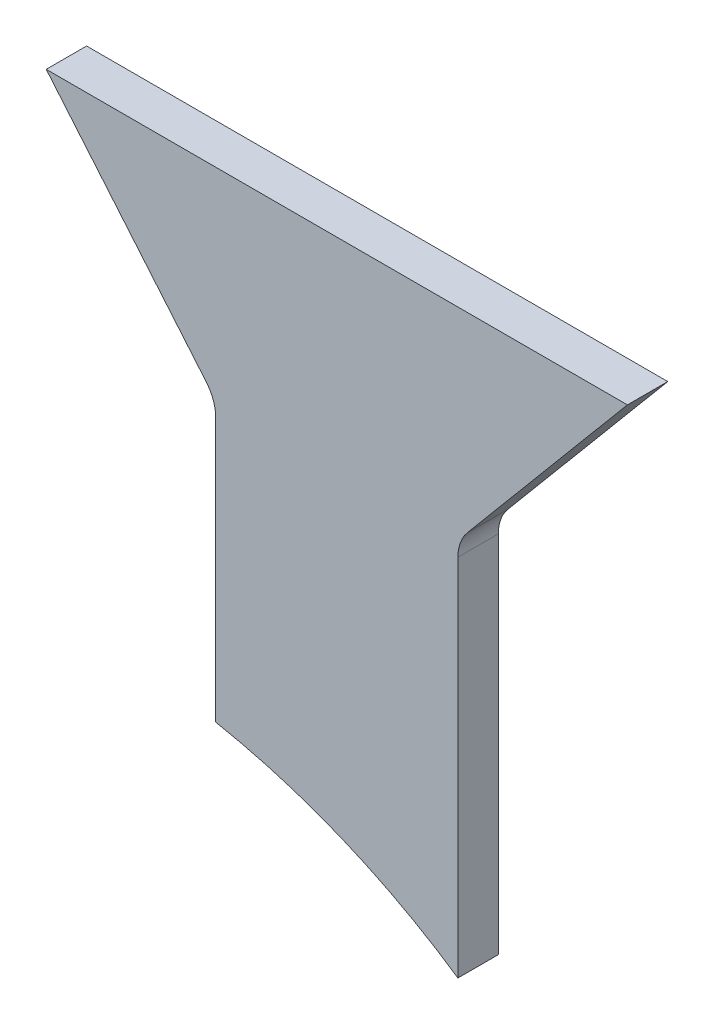
ISO-10303-21;
HEADER;
FILE_DESCRIPTION(('STEP AP214'),'2;1');
FILE_NAME('part.step','',(''),(''),'','','');
FILE_SCHEMA(('AUTOMOTIVE_DESIGN { 1 0 10303 214 1 1 1 1 }'));
ENDSEC;
DATA;
#1=APPLICATION_CONTEXT('core data for automotive mechanical design processes');
#2=APPLICATION_PROTOCOL_DEFINITION('international standard','automotive_design',2000,#1);
#3=PRODUCT_CONTEXT('',#1,'mechanical');
#4=PRODUCT('Part','Part','',(#3));
#5=PRODUCT_RELATED_PRODUCT_CATEGORY('part','',(#4));
#6=PRODUCT_DEFINITION_FORMATION('','',#4);
#7=PRODUCT_DEFINITION_CONTEXT('part definition',#1,'design');
#8=PRODUCT_DEFINITION('design','',#6,#7);
#9=PRODUCT_DEFINITION_SHAPE('','',#8);
#10=(LENGTH_UNIT() NAMED_UNIT(*) SI_UNIT(.MILLI.,.METRE.));
#11=(NAMED_UNIT(*) PLANE_ANGLE_UNIT() SI_UNIT($,.RADIAN.));
#12=(NAMED_UNIT(*) SI_UNIT($,.STERADIAN.) SOLID_ANGLE_UNIT());
#13=UNCERTAINTY_MEASURE_WITH_UNIT(LENGTH_MEASURE(1.E-05),#10,'distance_accuracy_value','');
#14=(GEOMETRIC_REPRESENTATION_CONTEXT(3) GLOBAL_UNCERTAINTY_ASSIGNED_CONTEXT((#13)) GLOBAL_UNIT_ASSIGNED_CONTEXT((#10,
#11,#12)) REPRESENTATION_CONTEXT('',''));
#15=CARTESIAN_POINT('',(0.,0.,0.));
#16=DIRECTION('',(0.,0.,1.));
#17=DIRECTION('',(1.,0.,0.));
#18=AXIS2_PLACEMENT_3D('',#15,#16,#17);
#19=CARTESIAN_POINT('',(-60.,-132.28756555323,10.));
#20=DIRECTION('',(0.,0.,-1.));
#21=DIRECTION('',(-1.,0.,0.));
#22=AXIS2_PLACEMENT_3D('',#19,#20,#21);
#23=CYLINDRICAL_SURFACE('',#22,160.);
#24=CARTESIAN_POINT('',(-60.,-132.28756555323,0.));
#25=DIRECTION('',(0.,0.,-1.));
#26=DIRECTION('',(1.,0.,0.));
#27=AXIS2_PLACEMENT_3D('',#24,#25,#26);
#28=CIRCLE('',#27,160.);
#29=CARTESIAN_POINT('',(-30.,24.8747709017876,0.));
#30=VERTEX_POINT('',#29);
#31=CARTESIAN_POINT('',(30.,0.,0.));
#32=VERTEX_POINT('',#31);
#33=EDGE_CURVE('E118',#30,#32,#28,.T.);
#34=ORIENTED_EDGE('',*,*,#33,.T.);
#35=DIRECTION('',(0.,0.,-1.));
#36=VECTOR('',#35,1.);
#37=CARTESIAN_POINT('',(30.,0.,10.));
#38=LINE('',#37,#36);
#39=CARTESIAN_POINT('',(30.,0.,10.));
#40=VERTEX_POINT('',#39);
#41=EDGE_CURVE('E101',#40,#32,#38,.T.);
#42=ORIENTED_EDGE('',*,*,#41,.F.);
#43=CARTESIAN_POINT('',(-60.,-132.28756555323,10.));
#44=DIRECTION('',(0.,0.,-1.));
#45=DIRECTION('',(1.,0.,0.));
#46=AXIS2_PLACEMENT_3D('',#43,#44,#45);
#47=CIRCLE('',#46,160.);
#48=CARTESIAN_POINT('',(-30.,24.8747709017876,10.));
#49=VERTEX_POINT('',#48);
#50=EDGE_CURVE('E106',#49,#40,#47,.T.);
#51=ORIENTED_EDGE('',*,*,#50,.F.);
#52=DIRECTION('',(0.,0.,-1.));
#53=VECTOR('',#52,1.);
#54=CARTESIAN_POINT('',(-30.,24.8747709017876,10.));
#55=LINE('',#54,#53);
#56=EDGE_CURVE('E148',#49,#30,#55,.T.);
#57=ORIENTED_EDGE('',*,*,#56,.T.);
#58=EDGE_LOOP('',(#34,#42,#51,#57));
#59=FACE_BOUND('',#58,.T.);
#60=ADVANCED_FACE('F36',(#59),#23,.F.);
#61=CARTESIAN_POINT('',(30.,0.,10.));
#62=DIRECTION('',(-1.,0.,0.));
#63=DIRECTION('',(0.,0.,1.));
#64=AXIS2_PLACEMENT_3D('',#61,#62,#63);
#65=PLANE('',#64);
#66=DIRECTION('',(0.,1.,0.));
#67=VECTOR('',#66,1.);
#68=CARTESIAN_POINT('',(30.,0.,0.));
#69=LINE('',#68,#67);
#70=CARTESIAN_POINT('',(30.,90.260297657338,0.));
#71=VERTEX_POINT('',#70);
#72=EDGE_CURVE('E167',#32,#71,#69,.T.);
#73=ORIENTED_EDGE('',*,*,#72,.T.);
#74=DIRECTION('',(0.,0.,-1.));
#75=VECTOR('',#74,1.);
#76=CARTESIAN_POINT('',(30.,90.260297657338,10.));
#77=LINE('',#76,#75);
#78=CARTESIAN_POINT('',(30.,90.260297657338,10.));
#79=VERTEX_POINT('',#78);
#80=EDGE_CURVE('E51',#71,#79,#77,.F.);
#81=ORIENTED_EDGE('',*,*,#80,.T.);
#82=DIRECTION('',(0.,1.,0.));
#83=VECTOR('',#82,1.);
#84=CARTESIAN_POINT('',(30.,0.,10.));
#85=LINE('',#84,#83);
#86=EDGE_CURVE('E97',#40,#79,#85,.T.);
#87=ORIENTED_EDGE('',*,*,#86,.F.);
#88=ORIENTED_EDGE('',*,*,#41,.T.);
#89=EDGE_LOOP('',(#73,#81,#87,#88));
#90=FACE_BOUND('',#89,.T.);
#91=ADVANCED_FACE('F99',(#90),#65,.F.);
#92=CARTESIAN_POINT('',(30.,93.9,10.));
#93=DIRECTION('',(-0.766044443118977,0.64278760968654,0.));
#94=DIRECTION('',(-0.64278760968654,-0.766044443118977,0.));
#95=AXIS2_PLACEMENT_3D('',#92,#93,#94);
#96=PLANE('',#95);
#97=DIRECTION('',(0.64278760968654,0.766044443118977,0.));
#98=VECTOR('',#97,1.);
#99=CARTESIAN_POINT('',(30.,93.9,10.));
#100=LINE('',#99,#98);
#101=CARTESIAN_POINT('',(32.3395555688102,96.6881737542034,10.));
#102=VERTEX_POINT('',#101);
#103=CARTESIAN_POINT('',(71.9740309125311,143.922702135669,10.));
#104=VERTEX_POINT('',#103);
#105=EDGE_CURVE('E105',#102,#104,#100,.T.);
#106=ORIENTED_EDGE('',*,*,#105,.F.);
#107=DIRECTION('',(0.,0.,-1.));
#108=VECTOR('',#107,1.);
#109=CARTESIAN_POINT('',(32.3395555688102,96.6881737542034,0.));
#110=LINE('',#109,#108);
#111=CARTESIAN_POINT('',(32.3395555688102,96.6881737542034,0.));
#112=VERTEX_POINT('',#111);
#113=EDGE_CURVE('E131',#102,#112,#110,.T.);
#114=ORIENTED_EDGE('',*,*,#113,.T.);
#115=DIRECTION('',(0.64278760968654,0.766044443118977,0.));
#116=VECTOR('',#115,1.);
#117=CARTESIAN_POINT('',(30.,93.9,0.));
#118=LINE('',#117,#116);
#119=CARTESIAN_POINT('',(71.9740309125311,143.922702135669,0.));
#120=VERTEX_POINT('',#119);
#121=EDGE_CURVE('E163',#112,#120,#118,.T.);
#122=ORIENTED_EDGE('',*,*,#121,.T.);
#123=DIRECTION('',(0.,0.,-1.));
#124=VECTOR('',#123,1.);
#125=CARTESIAN_POINT('',(71.9740309125311,143.922702135669,10.));
#126=LINE('',#125,#124);
#127=EDGE_CURVE('E120',#104,#120,#126,.T.);
#128=ORIENTED_EDGE('',*,*,#127,.F.);
#129=EDGE_LOOP('',(#106,#114,#122,#128));
#130=FACE_BOUND('',#129,.T.);
#131=ADVANCED_FACE('F174',(#130),#96,.F.);
#132=CARTESIAN_POINT('',(-71.9740309125311,143.922702135669,10.));
#133=DIRECTION('',(0.,-1.,0.));
#134=DIRECTION('',(0.,0.,-1.));
#135=AXIS2_PLACEMENT_3D('',#132,#133,#134);
#136=PLANE('',#135);
#137=DIRECTION('',(-1.,0.,0.));
#138=VECTOR('',#137,1.);
#139=CARTESIAN_POINT('',(-71.9740309125311,143.922702135669,0.));
#140=LINE('',#139,#138);
#141=CARTESIAN_POINT('',(-71.9740309125311,143.922702135669,0.));
#142=VERTEX_POINT('',#141);
#143=EDGE_CURVE('E160',#120,#142,#140,.T.);
#144=ORIENTED_EDGE('',*,*,#143,.T.);
#145=DIRECTION('',(0.,0.,-1.));
#146=VECTOR('',#145,1.);
#147=CARTESIAN_POINT('',(-71.9740309125311,143.922702135669,10.));
#148=LINE('',#147,#146);
#149=CARTESIAN_POINT('',(-71.9740309125311,143.922702135669,10.));
#150=VERTEX_POINT('',#149);
#151=EDGE_CURVE('E126',#150,#142,#148,.T.);
#152=ORIENTED_EDGE('',*,*,#151,.F.);
#153=DIRECTION('',(-1.,0.,0.));
#154=VECTOR('',#153,1.);
#155=CARTESIAN_POINT('',(-71.9740309125311,143.922702135669,10.));
#156=LINE('',#155,#154);
#157=EDGE_CURVE('E179',#104,#150,#156,.T.);
#158=ORIENTED_EDGE('',*,*,#157,.F.);
#159=ORIENTED_EDGE('',*,*,#127,.T.);
#160=EDGE_LOOP('',(#144,#152,#158,#159));
#161=FACE_BOUND('',#160,.T.);
#162=ADVANCED_FACE('F178',(#161),#136,.F.);
#163=CARTESIAN_POINT('',(-30.,93.9,10.));
#164=DIRECTION('',(0.766044443118977,0.64278760968654,0.));
#165=DIRECTION('',(-0.64278760968654,0.766044443118977,0.));
#166=AXIS2_PLACEMENT_3D('',#163,#164,#165);
#167=PLANE('',#166);
#168=DIRECTION('',(0.64278760968654,-0.766044443118977,0.));
#169=VECTOR('',#168,1.);
#170=CARTESIAN_POINT('',(-30.,93.9,0.));
#171=LINE('',#170,#169);
#172=CARTESIAN_POINT('',(-32.3395555688102,96.6881737542034,0.));
#173=VERTEX_POINT('',#172);
#174=EDGE_CURVE('E155',#142,#173,#171,.T.);
#175=ORIENTED_EDGE('',*,*,#174,.T.);
#176=DIRECTION('',(0.,0.,-1.));
#177=VECTOR('',#176,1.);
#178=CARTESIAN_POINT('',(-32.3395555688102,96.6881737542034,10.));
#179=LINE('',#178,#177);
#180=CARTESIAN_POINT('',(-32.3395555688102,96.6881737542034,10.));
#181=VERTEX_POINT('',#180);
#182=EDGE_CURVE('E123',#173,#181,#179,.F.);
#183=ORIENTED_EDGE('',*,*,#182,.T.);
#184=DIRECTION('',(0.64278760968654,-0.766044443118977,0.));
#185=VECTOR('',#184,1.);
#186=CARTESIAN_POINT('',(-30.,93.9,10.));
#187=LINE('',#186,#185);
#188=EDGE_CURVE('E141',#150,#181,#187,.T.);
#189=ORIENTED_EDGE('',*,*,#188,.F.);
#190=ORIENTED_EDGE('',*,*,#151,.T.);
#191=EDGE_LOOP('',(#175,#183,#189,#190));
#192=FACE_BOUND('',#191,.T.);
#193=ADVANCED_FACE('F158',(#192),#167,.F.);
#194=CARTESIAN_POINT('',(-30.,24.8747709017876,10.));
#195=DIRECTION('',(1.,0.,0.));
#196=DIRECTION('',(0.,1.,0.));
#197=AXIS2_PLACEMENT_3D('',#194,#195,#196);
#198=PLANE('',#197);
#199=DIRECTION('',(0.,-1.,0.));
#200=VECTOR('',#199,1.);
#201=CARTESIAN_POINT('',(-30.,24.8747709017876,10.));
#202=LINE('',#201,#200);
#203=CARTESIAN_POINT('',(-30.,90.260297657338,10.));
#204=VERTEX_POINT('',#203);
#205=EDGE_CURVE('E111',#204,#49,#202,.T.);
#206=ORIENTED_EDGE('',*,*,#205,.F.);
#207=DIRECTION('',(0.,0.,-1.));
#208=VECTOR('',#207,1.);
#209=CARTESIAN_POINT('',(-30.,90.260297657338,0.));
#210=LINE('',#209,#208);
#211=CARTESIAN_POINT('',(-30.,90.260297657338,0.));
#212=VERTEX_POINT('',#211);
#213=EDGE_CURVE('E119',#204,#212,#210,.T.);
#214=ORIENTED_EDGE('',*,*,#213,.T.);
#215=DIRECTION('',(0.,-1.,0.));
#216=VECTOR('',#215,1.);
#217=CARTESIAN_POINT('',(-30.,24.8747709017876,0.));
#218=LINE('',#217,#216);
#219=EDGE_CURVE('E115',#212,#30,#218,.T.);
#220=ORIENTED_EDGE('',*,*,#219,.T.);
#221=ORIENTED_EDGE('',*,*,#56,.F.);
#222=EDGE_LOOP('',(#206,#214,#220,#221));
#223=FACE_BOUND('',#222,.T.);
#224=ADVANCED_FACE('F146',(#223),#198,.F.);
#225=CARTESIAN_POINT('',(-60.,-132.28756555323,10.));
#226=DIRECTION('',(0.,0.,1.));
#227=DIRECTION('',(1.,0.,0.));
#228=AXIS2_PLACEMENT_3D('',#225,#226,#227);
#229=PLANE('',#228);
#230=ORIENTED_EDGE('',*,*,#50,.T.);
#231=ORIENTED_EDGE('',*,*,#86,.T.);
#232=CARTESIAN_POINT('',(40.,90.260297657338,10.));
#233=DIRECTION('',(0.,0.,1.));
#234=DIRECTION('',(1.,0.,0.));
#235=AXIS2_PLACEMENT_3D('',#232,#233,#234);
#236=CIRCLE('',#235,10.);
#237=EDGE_CURVE('E11',#79,#102,#236,.F.);
#238=ORIENTED_EDGE('',*,*,#237,.T.);
#239=ORIENTED_EDGE('',*,*,#105,.T.);
#240=ORIENTED_EDGE('',*,*,#157,.T.);
#241=ORIENTED_EDGE('',*,*,#188,.T.);
#242=CARTESIAN_POINT('',(-40.,90.260297657338,10.));
#243=DIRECTION('',(0.,0.,1.));
#244=DIRECTION('',(1.,0.,0.));
#245=AXIS2_PLACEMENT_3D('',#242,#243,#244);
#246=CIRCLE('',#245,10.);
#247=EDGE_CURVE('E137',#181,#204,#246,.F.);
#248=ORIENTED_EDGE('',*,*,#247,.T.);
#249=ORIENTED_EDGE('',*,*,#205,.T.);
#250=EDGE_LOOP('',(#230,#231,#238,#239,#240,#241,#248,#249));
#251=FACE_BOUND('',#250,.T.);
#252=ADVANCED_FACE('F109',(#251),#229,.T.);
#253=CARTESIAN_POINT('',(-60.,-132.28756555323,0.));
#254=DIRECTION('',(0.,0.,1.));
#255=DIRECTION('',(1.,0.,0.));
#256=AXIS2_PLACEMENT_3D('',#253,#254,#255);
#257=PLANE('',#256);
#258=ORIENTED_EDGE('',*,*,#33,.F.);
#259=ORIENTED_EDGE('',*,*,#219,.F.);
#260=CARTESIAN_POINT('',(-40.,90.260297657338,0.));
#261=DIRECTION('',(0.,0.,1.));
#262=DIRECTION('',(1.,0.,0.));
#263=AXIS2_PLACEMENT_3D('',#260,#261,#262);
#264=CIRCLE('',#263,10.);
#265=EDGE_CURVE('E135',#212,#173,#264,.T.);
#266=ORIENTED_EDGE('',*,*,#265,.T.);
#267=ORIENTED_EDGE('',*,*,#174,.F.);
#268=ORIENTED_EDGE('',*,*,#143,.F.);
#269=ORIENTED_EDGE('',*,*,#121,.F.);
#270=CARTESIAN_POINT('',(40.,90.260297657338,0.));
#271=DIRECTION('',(0.,0.,1.));
#272=DIRECTION('',(1.,0.,0.));
#273=AXIS2_PLACEMENT_3D('',#270,#271,#272);
#274=CIRCLE('',#273,10.);
#275=EDGE_CURVE('E44',#112,#71,#274,.T.);
#276=ORIENTED_EDGE('',*,*,#275,.T.);
#277=ORIENTED_EDGE('',*,*,#72,.F.);
#278=EDGE_LOOP('',(#258,#259,#266,#267,#268,#269,#276,#277));
#279=FACE_BOUND('',#278,.T.);
#280=ADVANCED_FACE('F153',(#279),#257,.F.);
#281=CARTESIAN_POINT('',(-40.,90.260297657338,10.));
#282=DIRECTION('',(0.,0.,1.));
#283=DIRECTION('',(1.,0.,0.));
#284=AXIS2_PLACEMENT_3D('',#281,#282,#283);
#285=CYLINDRICAL_SURFACE('',#284,10.);
#286=ORIENTED_EDGE('',*,*,#247,.F.);
#287=ORIENTED_EDGE('',*,*,#182,.F.);
#288=ORIENTED_EDGE('',*,*,#265,.F.);
#289=ORIENTED_EDGE('',*,*,#213,.F.);
#290=EDGE_LOOP('',(#286,#287,#288,#289));
#291=FACE_BOUND('',#290,.T.);
#292=ADVANCED_FACE('F150',(#291),#285,.F.);
#293=CARTESIAN_POINT('',(40.,90.260297657338,10.));
#294=DIRECTION('',(0.,0.,1.));
#295=DIRECTION('',(1.,0.,0.));
#296=AXIS2_PLACEMENT_3D('',#293,#294,#295);
#297=CYLINDRICAL_SURFACE('',#296,10.);
#298=ORIENTED_EDGE('',*,*,#237,.F.);
#299=ORIENTED_EDGE('',*,*,#80,.F.);
#300=ORIENTED_EDGE('',*,*,#275,.F.);
#301=ORIENTED_EDGE('',*,*,#113,.F.);
#302=EDGE_LOOP('',(#298,#299,#300,#301));
#303=FACE_BOUND('',#302,.T.);
#304=ADVANCED_FACE('F38',(#303),#297,.F.);
#305=CLOSED_SHELL('',(#60,#91,#131,#162,#193,#224,#252,#280,#292,#304));
#306=MANIFOLD_SOLID_BREP('B2',#305);
#307=ADVANCED_BREP_SHAPE_REPRESENTATION('',(#18,#306),#14);
#308=SHAPE_DEFINITION_REPRESENTATION(#9,#307);
ENDSEC;
END-ISO-10303-21;
